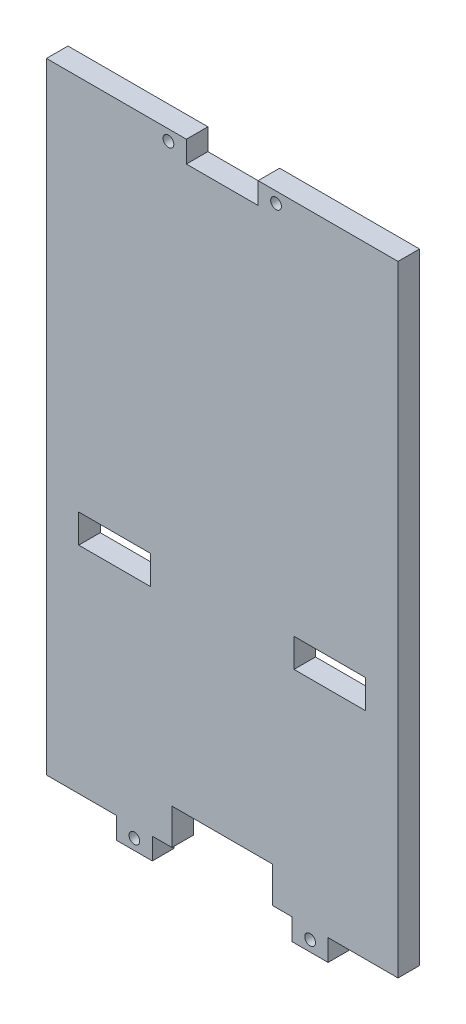
ISO-10303-21;
HEADER;
FILE_DESCRIPTION(('STEP AP214'),'2;1');
FILE_NAME('part.step','',(''),(''),'','','');
FILE_SCHEMA(('AUTOMOTIVE_DESIGN { 1 0 10303 214 1 1 1 1 }'));
ENDSEC;
DATA;
#1=APPLICATION_CONTEXT('core data for automotive mechanical design processes');
#2=APPLICATION_PROTOCOL_DEFINITION('international standard','automotive_design',2000,#1);
#3=PRODUCT_CONTEXT('',#1,'mechanical');
#4=PRODUCT('Part','Part','',(#3));
#5=PRODUCT_RELATED_PRODUCT_CATEGORY('part','',(#4));
#6=PRODUCT_DEFINITION_FORMATION('','',#4);
#7=PRODUCT_DEFINITION_CONTEXT('part definition',#1,'design');
#8=PRODUCT_DEFINITION('design','',#6,#7);
#9=PRODUCT_DEFINITION_SHAPE('','',#8);
#10=(LENGTH_UNIT() NAMED_UNIT(*) SI_UNIT(.MILLI.,.METRE.));
#11=(NAMED_UNIT(*) PLANE_ANGLE_UNIT() SI_UNIT($,.RADIAN.));
#12=(NAMED_UNIT(*) SI_UNIT($,.STERADIAN.) SOLID_ANGLE_UNIT());
#13=UNCERTAINTY_MEASURE_WITH_UNIT(LENGTH_MEASURE(1.E-05),#10,'distance_accuracy_value','');
#14=(GEOMETRIC_REPRESENTATION_CONTEXT(3) GLOBAL_UNCERTAINTY_ASSIGNED_CONTEXT((#13)) GLOBAL_UNIT_ASSIGNED_CONTEXT((#10,
#11,#12)) REPRESENTATION_CONTEXT('',''));
#15=CARTESIAN_POINT('',(0.,0.,0.));
#16=DIRECTION('',(0.,0.,1.));
#17=DIRECTION('',(1.,0.,0.));
#18=AXIS2_PLACEMENT_3D('',#15,#16,#17);
#19=CARTESIAN_POINT('',(-49.,-86.5,6.));
#20=DIRECTION('',(0.,1.,0.));
#21=DIRECTION('',(0.,0.,1.));
#22=AXIS2_PLACEMENT_3D('',#19,#20,#21);
#23=PLANE('',#22);
#24=DIRECTION('',(1.,0.,0.));
#25=VECTOR('',#24,1.);
#26=CARTESIAN_POINT('',(-49.,-86.5,0.));
#27=LINE('',#26,#25);
#28=CARTESIAN_POINT('',(-19.5,-86.5,0.));
#29=VERTEX_POINT('',#28);
#30=CARTESIAN_POINT('',(-14.,-86.5,0.));
#31=VERTEX_POINT('',#30);
#32=EDGE_CURVE('E238',#29,#31,#27,.T.);
#33=ORIENTED_EDGE('',*,*,#32,.T.);
#34=DIRECTION('',(0.,0.,1.));
#35=VECTOR('',#34,1.);
#36=CARTESIAN_POINT('',(-14.,-86.5,0.));
#37=LINE('',#36,#35);
#38=CARTESIAN_POINT('',(-14.,-86.5,6.));
#39=VERTEX_POINT('',#38);
#40=EDGE_CURVE('E221',#31,#39,#37,.T.);
#41=ORIENTED_EDGE('',*,*,#40,.T.);
#42=DIRECTION('',(1.,0.,0.));
#43=VECTOR('',#42,1.);
#44=CARTESIAN_POINT('',(-49.,-86.5,6.));
#45=LINE('',#44,#43);
#46=CARTESIAN_POINT('',(-19.5,-86.5,6.));
#47=VERTEX_POINT('',#46);
#48=EDGE_CURVE('E258',#47,#39,#45,.T.);
#49=ORIENTED_EDGE('',*,*,#48,.F.);
#50=DIRECTION('',(0.,0.,1.));
#51=VECTOR('',#50,1.);
#52=CARTESIAN_POINT('',(-19.5,-86.5,0.));
#53=LINE('',#52,#51);
#54=EDGE_CURVE('E245',#29,#47,#53,.T.);
#55=ORIENTED_EDGE('',*,*,#54,.F.);
#56=EDGE_LOOP('',(#33,#41,#49,#55));
#57=FACE_BOUND('',#56,.T.);
#58=ADVANCED_FACE('F33',(#57),#23,.F.);
#59=CARTESIAN_POINT('',(-49.,86.4999999999999,6.));
#60=DIRECTION('',(0.,-1.,0.));
#61=DIRECTION('',(0.,0.,-1.));
#62=AXIS2_PLACEMENT_3D('',#59,#60,#61);
#63=PLANE('',#62);
#64=DIRECTION('',(-1.,0.,0.));
#65=VECTOR('',#64,1.);
#66=CARTESIAN_POINT('',(-49.,86.4999999999999,6.));
#67=LINE('',#66,#65);
#68=CARTESIAN_POINT('',(-9.99999999999997,86.4999999999999,6.));
#69=VERTEX_POINT('',#68);
#70=CARTESIAN_POINT('',(-49.,86.4999999999999,6.));
#71=VERTEX_POINT('',#70);
#72=EDGE_CURVE('E428',#69,#71,#67,.T.);
#73=ORIENTED_EDGE('',*,*,#72,.F.);
#74=DIRECTION('',(0.,0.,1.));
#75=VECTOR('',#74,1.);
#76=CARTESIAN_POINT('',(-9.99999999999997,86.4999999999999,0.));
#77=LINE('',#76,#75);
#78=CARTESIAN_POINT('',(-9.99999999999997,86.4999999999999,0.));
#79=VERTEX_POINT('',#78);
#80=EDGE_CURVE('E325',#79,#69,#77,.T.);
#81=ORIENTED_EDGE('',*,*,#80,.F.);
#82=DIRECTION('',(-1.,0.,0.));
#83=VECTOR('',#82,1.);
#84=CARTESIAN_POINT('',(-49.,86.4999999999999,0.));
#85=LINE('',#84,#83);
#86=CARTESIAN_POINT('',(-49.,86.4999999999999,0.));
#87=VERTEX_POINT('',#86);
#88=EDGE_CURVE('E282',#79,#87,#85,.T.);
#89=ORIENTED_EDGE('',*,*,#88,.T.);
#90=DIRECTION('',(0.,0.,-1.));
#91=VECTOR('',#90,1.);
#92=CARTESIAN_POINT('',(-49.,86.4999999999999,6.));
#93=LINE('',#92,#91);
#94=EDGE_CURVE('E276',#71,#87,#93,.T.);
#95=ORIENTED_EDGE('',*,*,#94,.F.);
#96=EDGE_LOOP('',(#73,#81,#89,#95));
#97=FACE_BOUND('',#96,.T.);
#98=ADVANCED_FACE('F437',(#97),#63,.F.);
#99=CARTESIAN_POINT('',(14.,-86.5,6.));
#100=VERTEX_POINT('',#99);
#101=CARTESIAN_POINT('',(19.5,-86.5,6.));
#102=VERTEX_POINT('',#101);
#103=EDGE_CURVE('E37',#100,#102,#45,.T.);
#104=ORIENTED_EDGE('',*,*,#103,.F.);
#105=DIRECTION('',(0.,0.,1.));
#106=VECTOR('',#105,1.);
#107=CARTESIAN_POINT('',(14.,-86.5,0.));
#108=LINE('',#107,#106);
#109=CARTESIAN_POINT('',(14.,-86.5,0.));
#110=VERTEX_POINT('',#109);
#111=EDGE_CURVE('E231',#110,#100,#108,.T.);
#112=ORIENTED_EDGE('',*,*,#111,.F.);
#113=CARTESIAN_POINT('',(19.5,-86.5,0.));
#114=VERTEX_POINT('',#113);
#115=EDGE_CURVE('E247',#110,#114,#27,.T.);
#116=ORIENTED_EDGE('',*,*,#115,.T.);
#117=DIRECTION('',(0.,0.,1.));
#118=VECTOR('',#117,1.);
#119=CARTESIAN_POINT('',(19.5,-86.5,0.));
#120=LINE('',#119,#118);
#121=EDGE_CURVE('E394',#114,#102,#120,.T.);
#122=ORIENTED_EDGE('',*,*,#121,.T.);
#123=EDGE_LOOP('',(#104,#112,#116,#122));
#124=FACE_BOUND('',#123,.T.);
#125=ADVANCED_FACE('F454',(#124),#23,.F.);
#126=DIRECTION('',(0.,0.,1.));
#127=VECTOR('',#126,1.);
#128=CARTESIAN_POINT('',(29.5,-86.5,0.));
#129=LINE('',#128,#127);
#130=CARTESIAN_POINT('',(29.5,-86.5,0.));
#131=VERTEX_POINT('',#130);
#132=CARTESIAN_POINT('',(29.5,-86.5,6.));
#133=VERTEX_POINT('',#132);
#134=EDGE_CURVE('E382',#131,#133,#129,.T.);
#135=ORIENTED_EDGE('',*,*,#134,.F.);
#136=CARTESIAN_POINT('',(49.,-86.5,0.));
#137=VERTEX_POINT('',#136);
#138=EDGE_CURVE('E252',#131,#137,#27,.T.);
#139=ORIENTED_EDGE('',*,*,#138,.T.);
#140=DIRECTION('',(0.,0.,-1.));
#141=VECTOR('',#140,1.);
#142=CARTESIAN_POINT('',(49.,-86.5,6.));
#143=LINE('',#142,#141);
#144=CARTESIAN_POINT('',(49.,-86.5,6.));
#145=VERTEX_POINT('',#144);
#146=EDGE_CURVE('E43',#145,#137,#143,.T.);
#147=ORIENTED_EDGE('',*,*,#146,.F.);
#148=EDGE_CURVE('E286',#133,#145,#45,.T.);
#149=ORIENTED_EDGE('',*,*,#148,.F.);
#150=EDGE_LOOP('',(#135,#139,#147,#149));
#151=FACE_BOUND('',#150,.T.);
#152=ADVANCED_FACE('F464',(#151),#23,.F.);
#153=CARTESIAN_POINT('',(0.,0.,6.));
#154=DIRECTION('',(0.,0.,1.));
#155=DIRECTION('',(1.,0.,0.));
#156=AXIS2_PLACEMENT_3D('',#153,#154,#155);
#157=PLANE('',#156);
#158=DIRECTION('',(0.,-1.,0.));
#159=VECTOR('',#158,1.);
#160=CARTESIAN_POINT('',(-14.,-86.5,6.));
#161=LINE('',#160,#159);
#162=CARTESIAN_POINT('',(-14.,-76.5000000000001,6.));
#163=VERTEX_POINT('',#162);
#164=EDGE_CURVE('E226',#163,#39,#161,.T.);
#165=ORIENTED_EDGE('',*,*,#164,.F.);
#166=DIRECTION('',(-1.,0.,0.));
#167=VECTOR('',#166,1.);
#168=CARTESIAN_POINT('',(-14.,-76.5000000000001,6.));
#169=LINE('',#168,#167);
#170=CARTESIAN_POINT('',(14.,-76.5000000000001,6.));
#171=VERTEX_POINT('',#170);
#172=EDGE_CURVE('E241',#171,#163,#169,.T.);
#173=ORIENTED_EDGE('',*,*,#172,.F.);
#174=DIRECTION('',(0.,1.,0.));
#175=VECTOR('',#174,1.);
#176=CARTESIAN_POINT('',(14.,-86.5,6.));
#177=LINE('',#176,#175);
#178=EDGE_CURVE('E447',#100,#171,#177,.T.);
#179=ORIENTED_EDGE('',*,*,#178,.F.);
#180=ORIENTED_EDGE('',*,*,#103,.T.);
#181=DIRECTION('',(0.,-1.,0.));
#182=VECTOR('',#181,1.);
#183=CARTESIAN_POINT('',(19.5,-86.5,6.));
#184=LINE('',#183,#182);
#185=CARTESIAN_POINT('',(19.5,-92.5000000000001,6.));
#186=VERTEX_POINT('',#185);
#187=EDGE_CURVE('E388',#102,#186,#184,.T.);
#188=ORIENTED_EDGE('',*,*,#187,.T.);
#189=DIRECTION('',(1.,0.,0.));
#190=VECTOR('',#189,1.);
#191=CARTESIAN_POINT('',(29.5,-92.5000000000001,6.));
#192=LINE('',#191,#190);
#193=CARTESIAN_POINT('',(29.5,-92.5000000000001,6.));
#194=VERTEX_POINT('',#193);
#195=EDGE_CURVE('E384',#186,#194,#192,.T.);
#196=ORIENTED_EDGE('',*,*,#195,.T.);
#197=DIRECTION('',(0.,1.,0.));
#198=VECTOR('',#197,1.);
#199=CARTESIAN_POINT('',(29.5,-86.5,6.));
#200=LINE('',#199,#198);
#201=EDGE_CURVE('E372',#194,#133,#200,.T.);
#202=ORIENTED_EDGE('',*,*,#201,.T.);
#203=ORIENTED_EDGE('',*,*,#148,.T.);
#204=DIRECTION('',(0.,1.,0.));
#205=VECTOR('',#204,1.);
#206=CARTESIAN_POINT('',(49.,86.4999999999999,6.));
#207=LINE('',#206,#205);
#208=CARTESIAN_POINT('',(49.,86.4999999999999,6.));
#209=VERTEX_POINT('',#208);
#210=EDGE_CURVE('E424',#145,#209,#207,.T.);
#211=ORIENTED_EDGE('',*,*,#210,.T.);
#212=CARTESIAN_POINT('',(10.,86.4999999999999,6.));
#213=VERTEX_POINT('',#212);
#214=EDGE_CURVE('E278',#209,#213,#67,.T.);
#215=ORIENTED_EDGE('',*,*,#214,.T.);
#216=DIRECTION('',(0.,1.,0.));
#217=VECTOR('',#216,1.);
#218=CARTESIAN_POINT('',(10.,86.4999999999999,6.));
#219=LINE('',#218,#217);
#220=CARTESIAN_POINT('',(10.,80.4999999999999,6.));
#221=VERTEX_POINT('',#220);
#222=EDGE_CURVE('E59',#221,#213,#219,.T.);
#223=ORIENTED_EDGE('',*,*,#222,.F.);
#224=DIRECTION('',(1.,0.,0.));
#225=VECTOR('',#224,1.);
#226=CARTESIAN_POINT('',(-9.99999999999997,80.4999999999999,6.));
#227=LINE('',#226,#225);
#228=CARTESIAN_POINT('',(-9.99999999999997,80.4999999999999,6.));
#229=VERTEX_POINT('',#228);
#230=EDGE_CURVE('E320',#229,#221,#227,.T.);
#231=ORIENTED_EDGE('',*,*,#230,.F.);
#232=DIRECTION('',(0.,-1.,0.));
#233=VECTOR('',#232,1.);
#234=CARTESIAN_POINT('',(-9.99999999999997,86.4999999999999,6.));
#235=LINE('',#234,#233);
#236=EDGE_CURVE('E317',#69,#229,#235,.T.);
#237=ORIENTED_EDGE('',*,*,#236,.F.);
#238=ORIENTED_EDGE('',*,*,#72,.T.);
#239=DIRECTION('',(0.,-1.,0.));
#240=VECTOR('',#239,1.);
#241=CARTESIAN_POINT('',(-49.,86.4999999999999,6.));
#242=LINE('',#241,#240);
#243=CARTESIAN_POINT('',(-49.,-86.5,6.));
#244=VERTEX_POINT('',#243);
#245=EDGE_CURVE('E281',#71,#244,#242,.T.);
#246=ORIENTED_EDGE('',*,*,#245,.T.);
#247=CARTESIAN_POINT('',(-29.5,-86.5,6.));
#248=VERTEX_POINT('',#247);
#249=EDGE_CURVE('E420',#244,#248,#45,.T.);
#250=ORIENTED_EDGE('',*,*,#249,.T.);
#251=DIRECTION('',(0.,-1.,0.));
#252=VECTOR('',#251,1.);
#253=CARTESIAN_POINT('',(-29.5,-86.5,6.));
#254=LINE('',#253,#252);
#255=CARTESIAN_POINT('',(-29.5,-92.5000000000001,6.));
#256=VERTEX_POINT('',#255);
#257=EDGE_CURVE('E365',#248,#256,#254,.T.);
#258=ORIENTED_EDGE('',*,*,#257,.T.);
#259=DIRECTION('',(1.,0.,0.));
#260=VECTOR('',#259,1.);
#261=CARTESIAN_POINT('',(-19.5,-92.5000000000001,6.));
#262=LINE('',#261,#260);
#263=CARTESIAN_POINT('',(-19.5,-92.5000000000001,6.));
#264=VERTEX_POINT('',#263);
#265=EDGE_CURVE('E358',#256,#264,#262,.T.);
#266=ORIENTED_EDGE('',*,*,#265,.T.);
#267=DIRECTION('',(0.,1.,0.));
#268=VECTOR('',#267,1.);
#269=CARTESIAN_POINT('',(-19.5,-86.5,6.));
#270=LINE('',#269,#268);
#271=EDGE_CURVE('E352',#264,#47,#270,.T.);
#272=ORIENTED_EDGE('',*,*,#271,.T.);
#273=ORIENTED_EDGE('',*,*,#48,.T.);
#274=EDGE_LOOP('',(#165,#173,#179,#180,#188,#196,#202,#203,#211,#215,#223,#231,#237,#238,#246,
#250,#258,#266,#272,#273));
#275=FACE_BOUND('',#274,.T.);
#276=CARTESIAN_POINT('',(-24.5,-89.5000000000001,6.));
#277=DIRECTION('',(0.,0.,1.));
#278=DIRECTION('',(1.,0.,0.));
#279=AXIS2_PLACEMENT_3D('',#276,#277,#278);
#280=CIRCLE('',#279,1.5);
#281=CARTESIAN_POINT('',(-23.,-89.5000000000001,6.));
#282=VERTEX_POINT('',#281);
#283=EDGE_CURVE('E327',#282,#282,#280,.T.);
#284=ORIENTED_EDGE('',*,*,#283,.F.);
#285=EDGE_LOOP('',(#284));
#286=FACE_BOUND('',#285,.T.);
#287=CARTESIAN_POINT('',(24.5,-89.5000000000001,6.));
#288=DIRECTION('',(0.,0.,1.));
#289=DIRECTION('',(1.,0.,0.));
#290=AXIS2_PLACEMENT_3D('',#287,#288,#289);
#291=CIRCLE('',#290,1.5);
#292=CARTESIAN_POINT('',(26.,-89.5000000000001,6.));
#293=VERTEX_POINT('',#292);
#294=EDGE_CURVE('E334',#293,#293,#291,.T.);
#295=ORIENTED_EDGE('',*,*,#294,.F.);
#296=EDGE_LOOP('',(#295));
#297=FACE_BOUND('',#296,.T.);
#298=CARTESIAN_POINT('',(15.,83.4999999999999,6.));
#299=DIRECTION('',(0.,0.,1.));
#300=DIRECTION('',(1.,0.,0.));
#301=AXIS2_PLACEMENT_3D('',#298,#299,#300);
#302=CIRCLE('',#301,1.5);
#303=CARTESIAN_POINT('',(16.5,83.4999999999999,6.));
#304=VERTEX_POINT('',#303);
#305=EDGE_CURVE('E340',#304,#304,#302,.T.);
#306=ORIENTED_EDGE('',*,*,#305,.F.);
#307=EDGE_LOOP('',(#306));
#308=FACE_BOUND('',#307,.T.);
#309=CARTESIAN_POINT('',(-15.,83.4999999999999,6.));
#310=DIRECTION('',(0.,0.,1.));
#311=DIRECTION('',(1.,0.,0.));
#312=AXIS2_PLACEMENT_3D('',#309,#310,#311);
#313=CIRCLE('',#312,1.5);
#314=CARTESIAN_POINT('',(-13.5,83.4999999999999,6.));
#315=VERTEX_POINT('',#314);
#316=EDGE_CURVE('E346',#315,#315,#313,.T.);
#317=ORIENTED_EDGE('',*,*,#316,.F.);
#318=EDGE_LOOP('',(#317));
#319=FACE_BOUND('',#318,.T.);
#320=DIRECTION('',(1.,0.,0.));
#321=VECTOR('',#320,1.);
#322=CARTESIAN_POINT('',(-40.,-26.5,6.));
#323=LINE('',#322,#321);
#324=CARTESIAN_POINT('',(-40.,-26.5,6.));
#325=VERTEX_POINT('',#324);
#326=CARTESIAN_POINT('',(-20.,-26.5,6.));
#327=VERTEX_POINT('',#326);
#328=EDGE_CURVE('E496',#325,#327,#323,.T.);
#329=ORIENTED_EDGE('',*,*,#328,.F.);
#330=DIRECTION('',(0.,-1.,0.));
#331=VECTOR('',#330,1.);
#332=CARTESIAN_POINT('',(-40.,-18.5,6.));
#333=LINE('',#332,#331);
#334=CARTESIAN_POINT('',(-40.,-18.5,6.));
#335=VERTEX_POINT('',#334);
#336=EDGE_CURVE('E482',#335,#325,#333,.T.);
#337=ORIENTED_EDGE('',*,*,#336,.F.);
#338=DIRECTION('',(-1.,0.,0.));
#339=VECTOR('',#338,1.);
#340=CARTESIAN_POINT('',(-40.,-18.5,6.));
#341=LINE('',#340,#339);
#342=CARTESIAN_POINT('',(-20.,-18.5,6.));
#343=VERTEX_POINT('',#342);
#344=EDGE_CURVE('E478',#343,#335,#341,.T.);
#345=ORIENTED_EDGE('',*,*,#344,.F.);
#346=DIRECTION('',(0.,1.,0.));
#347=VECTOR('',#346,1.);
#348=CARTESIAN_POINT('',(-20.,-18.5,6.));
#349=LINE('',#348,#347);
#350=EDGE_CURVE('E493',#327,#343,#349,.T.);
#351=ORIENTED_EDGE('',*,*,#350,.F.);
#352=EDGE_LOOP('',(#329,#337,#345,#351));
#353=FACE_BOUND('',#352,.T.);
#354=DIRECTION('',(0.,-1.,0.));
#355=VECTOR('',#354,1.);
#356=CARTESIAN_POINT('',(20.,-18.5,6.));
#357=LINE('',#356,#355);
#358=CARTESIAN_POINT('',(20.,-18.5,6.));
#359=VERTEX_POINT('',#358);
#360=CARTESIAN_POINT('',(20.,-26.5,6.));
#361=VERTEX_POINT('',#360);
#362=EDGE_CURVE('E525',#359,#361,#357,.T.);
#363=ORIENTED_EDGE('',*,*,#362,.F.);
#364=DIRECTION('',(-1.,0.,0.));
#365=VECTOR('',#364,1.);
#366=CARTESIAN_POINT('',(40.,-18.5,6.));
#367=LINE('',#366,#365);
#368=CARTESIAN_POINT('',(40.,-18.5,6.));
#369=VERTEX_POINT('',#368);
#370=EDGE_CURVE('E512',#369,#359,#367,.T.);
#371=ORIENTED_EDGE('',*,*,#370,.F.);
#372=DIRECTION('',(0.,1.,0.));
#373=VECTOR('',#372,1.);
#374=CARTESIAN_POINT('',(40.,-18.5,6.));
#375=LINE('',#374,#373);
#376=CARTESIAN_POINT('',(40.,-26.5,6.));
#377=VERTEX_POINT('',#376);
#378=EDGE_CURVE('E508',#377,#369,#375,.T.);
#379=ORIENTED_EDGE('',*,*,#378,.F.);
#380=DIRECTION('',(1.,0.,0.));
#381=VECTOR('',#380,1.);
#382=CARTESIAN_POINT('',(40.,-26.5,6.));
#383=LINE('',#382,#381);
#384=EDGE_CURVE('E522',#361,#377,#383,.T.);
#385=ORIENTED_EDGE('',*,*,#384,.F.);
#386=EDGE_LOOP('',(#363,#371,#379,#385));
#387=FACE_BOUND('',#386,.T.);
#388=ADVANCED_FACE('F431',(#275,#286,#297,#308,#319,#353,#387),#157,.T.);
#389=CARTESIAN_POINT('',(0.,0.,0.));
#390=DIRECTION('',(0.,0.,1.));
#391=DIRECTION('',(1.,0.,0.));
#392=AXIS2_PLACEMENT_3D('',#389,#390,#391);
#393=PLANE('',#392);
#394=DIRECTION('',(-1.,0.,0.));
#395=VECTOR('',#394,1.);
#396=CARTESIAN_POINT('',(-14.,-76.5000000000001,0.));
#397=LINE('',#396,#395);
#398=CARTESIAN_POINT('',(14.,-76.5000000000001,0.));
#399=VERTEX_POINT('',#398);
#400=CARTESIAN_POINT('',(-14.,-76.5000000000001,0.));
#401=VERTEX_POINT('',#400);
#402=EDGE_CURVE('E51',#399,#401,#397,.T.);
#403=ORIENTED_EDGE('',*,*,#402,.T.);
#404=DIRECTION('',(0.,-1.,0.));
#405=VECTOR('',#404,1.);
#406=CARTESIAN_POINT('',(-14.,-86.5,0.));
#407=LINE('',#406,#405);
#408=EDGE_CURVE('E224',#401,#31,#407,.T.);
#409=ORIENTED_EDGE('',*,*,#408,.T.);
#410=ORIENTED_EDGE('',*,*,#32,.F.);
#411=DIRECTION('',(0.,1.,0.));
#412=VECTOR('',#411,1.);
#413=CARTESIAN_POINT('',(-19.5,-86.5,0.));
#414=LINE('',#413,#412);
#415=CARTESIAN_POINT('',(-19.5,-92.5000000000001,0.));
#416=VERTEX_POINT('',#415);
#417=EDGE_CURVE('E355',#416,#29,#414,.T.);
#418=ORIENTED_EDGE('',*,*,#417,.F.);
#419=DIRECTION('',(1.,0.,0.));
#420=VECTOR('',#419,1.);
#421=CARTESIAN_POINT('',(-19.5,-92.5000000000001,0.));
#422=LINE('',#421,#420);
#423=CARTESIAN_POINT('',(-29.5,-92.5000000000001,0.));
#424=VERTEX_POINT('',#423);
#425=EDGE_CURVE('E361',#424,#416,#422,.T.);
#426=ORIENTED_EDGE('',*,*,#425,.F.);
#427=DIRECTION('',(0.,-1.,0.));
#428=VECTOR('',#427,1.);
#429=CARTESIAN_POINT('',(-29.5,-86.5,0.));
#430=LINE('',#429,#428);
#431=CARTESIAN_POINT('',(-29.5,-86.5,0.));
#432=VERTEX_POINT('',#431);
#433=EDGE_CURVE('E357',#432,#424,#430,.T.);
#434=ORIENTED_EDGE('',*,*,#433,.F.);
#435=CARTESIAN_POINT('',(-49.,-86.5,0.));
#436=VERTEX_POINT('',#435);
#437=EDGE_CURVE('E246',#436,#432,#27,.T.);
#438=ORIENTED_EDGE('',*,*,#437,.F.);
#439=DIRECTION('',(0.,-1.,0.));
#440=VECTOR('',#439,1.);
#441=CARTESIAN_POINT('',(-49.,86.4999999999999,0.));
#442=LINE('',#441,#440);
#443=EDGE_CURVE('E262',#87,#436,#442,.T.);
#444=ORIENTED_EDGE('',*,*,#443,.F.);
#445=ORIENTED_EDGE('',*,*,#88,.F.);
#446=DIRECTION('',(0.,-1.,0.));
#447=VECTOR('',#446,1.);
#448=CARTESIAN_POINT('',(-9.99999999999997,86.4999999999999,0.));
#449=LINE('',#448,#447);
#450=CARTESIAN_POINT('',(-9.99999999999997,80.4999999999999,0.));
#451=VERTEX_POINT('',#450);
#452=EDGE_CURVE('E313',#79,#451,#449,.T.);
#453=ORIENTED_EDGE('',*,*,#452,.T.);
#454=DIRECTION('',(1.,0.,0.));
#455=VECTOR('',#454,1.);
#456=CARTESIAN_POINT('',(-9.99999999999997,80.4999999999999,0.));
#457=LINE('',#456,#455);
#458=CARTESIAN_POINT('',(10.,80.4999999999999,0.));
#459=VERTEX_POINT('',#458);
#460=EDGE_CURVE('E308',#451,#459,#457,.T.);
#461=ORIENTED_EDGE('',*,*,#460,.T.);
#462=DIRECTION('',(0.,1.,0.));
#463=VECTOR('',#462,1.);
#464=CARTESIAN_POINT('',(10.,86.4999999999999,0.));
#465=LINE('',#464,#463);
#466=CARTESIAN_POINT('',(10.,86.4999999999999,0.));
#467=VERTEX_POINT('',#466);
#468=EDGE_CURVE('E305',#459,#467,#465,.T.);
#469=ORIENTED_EDGE('',*,*,#468,.T.);
#470=CARTESIAN_POINT('',(49.,86.4999999999999,0.));
#471=VERTEX_POINT('',#470);
#472=EDGE_CURVE('E279',#471,#467,#85,.T.);
#473=ORIENTED_EDGE('',*,*,#472,.F.);
#474=DIRECTION('',(0.,1.,0.));
#475=VECTOR('',#474,1.);
#476=CARTESIAN_POINT('',(49.,86.4999999999999,0.));
#477=LINE('',#476,#475);
#478=EDGE_CURVE('E250',#137,#471,#477,.T.);
#479=ORIENTED_EDGE('',*,*,#478,.F.);
#480=ORIENTED_EDGE('',*,*,#138,.F.);
#481=DIRECTION('',(0.,1.,0.));
#482=VECTOR('',#481,1.);
#483=CARTESIAN_POINT('',(29.5,-86.5,0.));
#484=LINE('',#483,#482);
#485=CARTESIAN_POINT('',(29.5,-92.5000000000001,0.));
#486=VERTEX_POINT('',#485);
#487=EDGE_CURVE('E387',#486,#131,#484,.T.);
#488=ORIENTED_EDGE('',*,*,#487,.F.);
#489=DIRECTION('',(1.,0.,0.));
#490=VECTOR('',#489,1.);
#491=CARTESIAN_POINT('',(29.5,-92.5000000000001,0.));
#492=LINE('',#491,#490);
#493=CARTESIAN_POINT('',(19.5,-92.5000000000001,0.));
#494=VERTEX_POINT('',#493);
#495=EDGE_CURVE('E379',#494,#486,#492,.T.);
#496=ORIENTED_EDGE('',*,*,#495,.F.);
#497=DIRECTION('',(0.,-1.,0.));
#498=VECTOR('',#497,1.);
#499=CARTESIAN_POINT('',(19.5,-86.5,0.));
#500=LINE('',#499,#498);
#501=EDGE_CURVE('E383',#114,#494,#500,.T.);
#502=ORIENTED_EDGE('',*,*,#501,.F.);
#503=ORIENTED_EDGE('',*,*,#115,.F.);
#504=DIRECTION('',(0.,1.,0.));
#505=VECTOR('',#504,1.);
#506=CARTESIAN_POINT('',(14.,-86.5,0.));
#507=LINE('',#506,#505);
#508=EDGE_CURVE('E240',#110,#399,#507,.T.);
#509=ORIENTED_EDGE('',*,*,#508,.T.);
#510=EDGE_LOOP('',(#403,#409,#410,#418,#426,#434,#438,#444,#445,#453,#461,#469,#473,#479,#480,
#488,#496,#502,#503,#509));
#511=FACE_BOUND('',#510,.T.);
#512=CARTESIAN_POINT('',(-24.5,-89.5000000000001,0.));
#513=DIRECTION('',(0.,0.,1.));
#514=DIRECTION('',(1.,0.,0.));
#515=AXIS2_PLACEMENT_3D('',#512,#513,#514);
#516=CIRCLE('',#515,1.5);
#517=CARTESIAN_POINT('',(-23.,-89.5000000000001,0.));
#518=VERTEX_POINT('',#517);
#519=EDGE_CURVE('E331',#518,#518,#516,.T.);
#520=ORIENTED_EDGE('',*,*,#519,.T.);
#521=EDGE_LOOP('',(#520));
#522=FACE_BOUND('',#521,.T.);
#523=CARTESIAN_POINT('',(24.5,-89.5000000000001,0.));
#524=DIRECTION('',(0.,0.,1.));
#525=DIRECTION('',(1.,0.,0.));
#526=AXIS2_PLACEMENT_3D('',#523,#524,#525);
#527=CIRCLE('',#526,1.5);
#528=CARTESIAN_POINT('',(26.,-89.5000000000001,0.));
#529=VERTEX_POINT('',#528);
#530=EDGE_CURVE('E337',#529,#529,#527,.T.);
#531=ORIENTED_EDGE('',*,*,#530,.T.);
#532=EDGE_LOOP('',(#531));
#533=FACE_BOUND('',#532,.T.);
#534=CARTESIAN_POINT('',(15.,83.4999999999999,0.));
#535=DIRECTION('',(0.,0.,1.));
#536=DIRECTION('',(1.,0.,0.));
#537=AXIS2_PLACEMENT_3D('',#534,#535,#536);
#538=CIRCLE('',#537,1.5);
#539=CARTESIAN_POINT('',(16.5,83.4999999999999,0.));
#540=VERTEX_POINT('',#539);
#541=EDGE_CURVE('E343',#540,#540,#538,.T.);
#542=ORIENTED_EDGE('',*,*,#541,.T.);
#543=EDGE_LOOP('',(#542));
#544=FACE_BOUND('',#543,.T.);
#545=CARTESIAN_POINT('',(-15.,83.4999999999999,0.));
#546=DIRECTION('',(0.,0.,1.));
#547=DIRECTION('',(1.,0.,0.));
#548=AXIS2_PLACEMENT_3D('',#545,#546,#547);
#549=CIRCLE('',#548,1.5);
#550=CARTESIAN_POINT('',(-13.5,83.4999999999999,0.));
#551=VERTEX_POINT('',#550);
#552=EDGE_CURVE('E349',#551,#551,#549,.T.);
#553=ORIENTED_EDGE('',*,*,#552,.T.);
#554=EDGE_LOOP('',(#553));
#555=FACE_BOUND('',#554,.T.);
#556=DIRECTION('',(0.,-1.,0.));
#557=VECTOR('',#556,1.);
#558=CARTESIAN_POINT('',(-40.,-18.5,0.));
#559=LINE('',#558,#557);
#560=CARTESIAN_POINT('',(-40.,-18.5,0.));
#561=VERTEX_POINT('',#560);
#562=CARTESIAN_POINT('',(-40.,-26.5,0.));
#563=VERTEX_POINT('',#562);
#564=EDGE_CURVE('E489',#561,#563,#559,.T.);
#565=ORIENTED_EDGE('',*,*,#564,.T.);
#566=DIRECTION('',(1.,0.,0.));
#567=VECTOR('',#566,1.);
#568=CARTESIAN_POINT('',(-40.,-26.5,0.));
#569=LINE('',#568,#567);
#570=CARTESIAN_POINT('',(-20.,-26.5,0.));
#571=VERTEX_POINT('',#570);
#572=EDGE_CURVE('E486',#563,#571,#569,.T.);
#573=ORIENTED_EDGE('',*,*,#572,.T.);
#574=DIRECTION('',(0.,1.,0.));
#575=VECTOR('',#574,1.);
#576=CARTESIAN_POINT('',(-20.,-18.5,0.));
#577=LINE('',#576,#575);
#578=CARTESIAN_POINT('',(-20.,-18.5,0.));
#579=VERTEX_POINT('',#578);
#580=EDGE_CURVE('E483',#571,#579,#577,.T.);
#581=ORIENTED_EDGE('',*,*,#580,.T.);
#582=DIRECTION('',(-1.,0.,0.));
#583=VECTOR('',#582,1.);
#584=CARTESIAN_POINT('',(-40.,-18.5,0.));
#585=LINE('',#584,#583);
#586=EDGE_CURVE('E479',#579,#561,#585,.T.);
#587=ORIENTED_EDGE('',*,*,#586,.T.);
#588=EDGE_LOOP('',(#565,#573,#581,#587));
#589=FACE_BOUND('',#588,.T.);
#590=DIRECTION('',(-1.,0.,0.));
#591=VECTOR('',#590,1.);
#592=CARTESIAN_POINT('',(40.,-18.5,0.));
#593=LINE('',#592,#591);
#594=CARTESIAN_POINT('',(40.,-18.5,0.));
#595=VERTEX_POINT('',#594);
#596=CARTESIAN_POINT('',(20.,-18.5,0.));
#597=VERTEX_POINT('',#596);
#598=EDGE_CURVE('E391',#595,#597,#593,.T.);
#599=ORIENTED_EDGE('',*,*,#598,.T.);
#600=DIRECTION('',(0.,-1.,0.));
#601=VECTOR('',#600,1.);
#602=CARTESIAN_POINT('',(20.,-18.5,0.));
#603=LINE('',#602,#601);
#604=CARTESIAN_POINT('',(20.,-26.5,0.));
#605=VERTEX_POINT('',#604);
#606=EDGE_CURVE('E516',#597,#605,#603,.T.);
#607=ORIENTED_EDGE('',*,*,#606,.T.);
#608=DIRECTION('',(1.,0.,0.));
#609=VECTOR('',#608,1.);
#610=CARTESIAN_POINT('',(40.,-26.5,0.));
#611=LINE('',#610,#609);
#612=CARTESIAN_POINT('',(40.,-26.5,0.));
#613=VERTEX_POINT('',#612);
#614=EDGE_CURVE('E513',#605,#613,#611,.T.);
#615=ORIENTED_EDGE('',*,*,#614,.T.);
#616=DIRECTION('',(0.,1.,0.));
#617=VECTOR('',#616,1.);
#618=CARTESIAN_POINT('',(40.,-18.5,0.));
#619=LINE('',#618,#617);
#620=EDGE_CURVE('E509',#613,#595,#619,.T.);
#621=ORIENTED_EDGE('',*,*,#620,.T.);
#622=EDGE_LOOP('',(#599,#607,#615,#621));
#623=FACE_BOUND('',#622,.T.);
#624=ADVANCED_FACE('F235',(#511,#522,#533,#544,#555,#589,#623),#393,.F.);
#625=CARTESIAN_POINT('',(-49.,86.4999999999999,6.));
#626=DIRECTION('',(1.,0.,0.));
#627=DIRECTION('',(0.,1.,0.));
#628=AXIS2_PLACEMENT_3D('',#625,#626,#627);
#629=PLANE('',#628);
#630=ORIENTED_EDGE('',*,*,#443,.T.);
#631=DIRECTION('',(0.,0.,-1.));
#632=VECTOR('',#631,1.);
#633=CARTESIAN_POINT('',(-49.,-86.5,6.));
#634=LINE('',#633,#632);
#635=EDGE_CURVE('E11',#244,#436,#634,.T.);
#636=ORIENTED_EDGE('',*,*,#635,.F.);
#637=ORIENTED_EDGE('',*,*,#245,.F.);
#638=ORIENTED_EDGE('',*,*,#94,.T.);
#639=EDGE_LOOP('',(#630,#636,#637,#638));
#640=FACE_BOUND('',#639,.T.);
#641=ADVANCED_FACE('F35',(#640),#629,.F.);
#642=ORIENTED_EDGE('',*,*,#437,.T.);
#643=DIRECTION('',(0.,0.,1.));
#644=VECTOR('',#643,1.);
#645=CARTESIAN_POINT('',(-29.5,-86.5,0.));
#646=LINE('',#645,#644);
#647=EDGE_CURVE('E375',#432,#248,#646,.T.);
#648=ORIENTED_EDGE('',*,*,#647,.T.);
#649=ORIENTED_EDGE('',*,*,#249,.F.);
#650=ORIENTED_EDGE('',*,*,#635,.T.);
#651=EDGE_LOOP('',(#642,#648,#649,#650));
#652=FACE_BOUND('',#651,.T.);
#653=ADVANCED_FACE('F442',(#652),#23,.F.);
#654=CARTESIAN_POINT('',(49.,86.4999999999999,6.));
#655=DIRECTION('',(-1.,0.,0.));
#656=DIRECTION('',(0.,-1.,0.));
#657=AXIS2_PLACEMENT_3D('',#654,#655,#656);
#658=PLANE('',#657);
#659=ORIENTED_EDGE('',*,*,#478,.T.);
#660=DIRECTION('',(0.,0.,-1.));
#661=VECTOR('',#660,1.);
#662=CARTESIAN_POINT('',(49.,86.4999999999999,6.));
#663=LINE('',#662,#661);
#664=EDGE_CURVE('E273',#209,#471,#663,.T.);
#665=ORIENTED_EDGE('',*,*,#664,.F.);
#666=ORIENTED_EDGE('',*,*,#210,.F.);
#667=ORIENTED_EDGE('',*,*,#146,.T.);
#668=EDGE_LOOP('',(#659,#665,#666,#667));
#669=FACE_BOUND('',#668,.T.);
#670=ADVANCED_FACE('F295',(#669),#658,.F.);
#671=ORIENTED_EDGE('',*,*,#472,.T.);
#672=DIRECTION('',(0.,0.,1.));
#673=VECTOR('',#672,1.);
#674=CARTESIAN_POINT('',(10.,86.4999999999999,0.));
#675=LINE('',#674,#673);
#676=EDGE_CURVE('E328',#467,#213,#675,.T.);
#677=ORIENTED_EDGE('',*,*,#676,.T.);
#678=ORIENTED_EDGE('',*,*,#214,.F.);
#679=ORIENTED_EDGE('',*,*,#664,.T.);
#680=EDGE_LOOP('',(#671,#677,#678,#679));
#681=FACE_BOUND('',#680,.T.);
#682=ADVANCED_FACE('F300',(#681),#63,.F.);
#683=CARTESIAN_POINT('',(-40.,-18.5,6.));
#684=DIRECTION('',(1.,0.,0.));
#685=DIRECTION('',(0.,1.,0.));
#686=AXIS2_PLACEMENT_3D('',#683,#684,#685);
#687=PLANE('',#686);
#688=ORIENTED_EDGE('',*,*,#564,.F.);
#689=DIRECTION('',(0.,0.,-1.));
#690=VECTOR('',#689,1.);
#691=CARTESIAN_POINT('',(-40.,-18.5,6.));
#692=LINE('',#691,#690);
#693=EDGE_CURVE('E475',#335,#561,#692,.T.);
#694=ORIENTED_EDGE('',*,*,#693,.F.);
#695=ORIENTED_EDGE('',*,*,#336,.T.);
#696=DIRECTION('',(0.,0.,-1.));
#697=VECTOR('',#696,1.);
#698=CARTESIAN_POINT('',(-40.,-26.5,6.));
#699=LINE('',#698,#697);
#700=EDGE_CURVE('E465',#325,#563,#699,.T.);
#701=ORIENTED_EDGE('',*,*,#700,.T.);
#702=EDGE_LOOP('',(#688,#694,#695,#701));
#703=FACE_BOUND('',#702,.T.);
#704=ADVANCED_FACE('F575',(#703),#687,.T.);
#705=CARTESIAN_POINT('',(-40.,-26.5,6.));
#706=DIRECTION('',(0.,1.,0.));
#707=DIRECTION('',(0.,0.,1.));
#708=AXIS2_PLACEMENT_3D('',#705,#706,#707);
#709=PLANE('',#708);
#710=ORIENTED_EDGE('',*,*,#572,.F.);
#711=ORIENTED_EDGE('',*,*,#700,.F.);
#712=ORIENTED_EDGE('',*,*,#328,.T.);
#713=DIRECTION('',(0.,0.,-1.));
#714=VECTOR('',#713,1.);
#715=CARTESIAN_POINT('',(-20.,-26.5,6.));
#716=LINE('',#715,#714);
#717=EDGE_CURVE('E467',#327,#571,#716,.T.);
#718=ORIENTED_EDGE('',*,*,#717,.T.);
#719=EDGE_LOOP('',(#710,#711,#712,#718));
#720=FACE_BOUND('',#719,.T.);
#721=ADVANCED_FACE('F581',(#720),#709,.T.);
#722=CARTESIAN_POINT('',(-20.,-18.5,6.));
#723=DIRECTION('',(-1.,0.,0.));
#724=DIRECTION('',(0.,0.,1.));
#725=AXIS2_PLACEMENT_3D('',#722,#723,#724);
#726=PLANE('',#725);
#727=ORIENTED_EDGE('',*,*,#580,.F.);
#728=ORIENTED_EDGE('',*,*,#717,.F.);
#729=ORIENTED_EDGE('',*,*,#350,.T.);
#730=DIRECTION('',(0.,0.,-1.));
#731=VECTOR('',#730,1.);
#732=CARTESIAN_POINT('',(-20.,-18.5,6.));
#733=LINE('',#732,#731);
#734=EDGE_CURVE('E471',#343,#579,#733,.T.);
#735=ORIENTED_EDGE('',*,*,#734,.T.);
#736=EDGE_LOOP('',(#727,#728,#729,#735));
#737=FACE_BOUND('',#736,.T.);
#738=ADVANCED_FACE('F585',(#737),#726,.T.);
#739=CARTESIAN_POINT('',(-40.,-18.5,6.));
#740=DIRECTION('',(0.,-1.,0.));
#741=DIRECTION('',(0.,0.,-1.));
#742=AXIS2_PLACEMENT_3D('',#739,#740,#741);
#743=PLANE('',#742);
#744=ORIENTED_EDGE('',*,*,#586,.F.);
#745=ORIENTED_EDGE('',*,*,#734,.F.);
#746=ORIENTED_EDGE('',*,*,#344,.T.);
#747=ORIENTED_EDGE('',*,*,#693,.T.);
#748=EDGE_LOOP('',(#744,#745,#746,#747));
#749=FACE_BOUND('',#748,.T.);
#750=ADVANCED_FACE('F592',(#749),#743,.T.);
#751=CARTESIAN_POINT('',(40.,-18.5,6.));
#752=DIRECTION('',(0.,-1.,0.));
#753=DIRECTION('',(1.,0.,0.));
#754=AXIS2_PLACEMENT_3D('',#751,#752,#753);
#755=PLANE('',#754);
#756=ORIENTED_EDGE('',*,*,#598,.F.);
#757=DIRECTION('',(0.,0.,-1.));
#758=VECTOR('',#757,1.);
#759=CARTESIAN_POINT('',(40.,-18.5,6.));
#760=LINE('',#759,#758);
#761=EDGE_CURVE('E505',#369,#595,#760,.T.);
#762=ORIENTED_EDGE('',*,*,#761,.F.);
#763=ORIENTED_EDGE('',*,*,#370,.T.);
#764=DIRECTION('',(0.,0.,-1.));
#765=VECTOR('',#764,1.);
#766=CARTESIAN_POINT('',(20.,-18.5,6.));
#767=LINE('',#766,#765);
#768=EDGE_CURVE('E491',#359,#597,#767,.T.);
#769=ORIENTED_EDGE('',*,*,#768,.T.);
#770=EDGE_LOOP('',(#756,#762,#763,#769));
#771=FACE_BOUND('',#770,.T.);
#772=ADVANCED_FACE('F530',(#771),#755,.T.);
#773=CARTESIAN_POINT('',(20.,-18.5,6.));
#774=DIRECTION('',(1.,0.,0.));
#775=DIRECTION('',(0.,0.,-1.));
#776=AXIS2_PLACEMENT_3D('',#773,#774,#775);
#777=PLANE('',#776);
#778=ORIENTED_EDGE('',*,*,#606,.F.);
#779=ORIENTED_EDGE('',*,*,#768,.F.);
#780=ORIENTED_EDGE('',*,*,#362,.T.);
#781=DIRECTION('',(0.,0.,-1.));
#782=VECTOR('',#781,1.);
#783=CARTESIAN_POINT('',(20.,-26.5,6.));
#784=LINE('',#783,#782);
#785=EDGE_CURVE('E501',#361,#605,#784,.T.);
#786=ORIENTED_EDGE('',*,*,#785,.T.);
#787=EDGE_LOOP('',(#778,#779,#780,#786));
#788=FACE_BOUND('',#787,.T.);
#789=ADVANCED_FACE('F535',(#788),#777,.T.);
#790=CARTESIAN_POINT('',(40.,-26.5,6.));
#791=DIRECTION('',(0.,1.,0.));
#792=DIRECTION('',(-1.,0.,0.));
#793=AXIS2_PLACEMENT_3D('',#790,#791,#792);
#794=PLANE('',#793);
#795=ORIENTED_EDGE('',*,*,#614,.F.);
#796=ORIENTED_EDGE('',*,*,#785,.F.);
#797=ORIENTED_EDGE('',*,*,#384,.T.);
#798=DIRECTION('',(0.,0.,-1.));
#799=VECTOR('',#798,1.);
#800=CARTESIAN_POINT('',(40.,-26.5,6.));
#801=LINE('',#800,#799);
#802=EDGE_CURVE('E503',#377,#613,#801,.T.);
#803=ORIENTED_EDGE('',*,*,#802,.T.);
#804=EDGE_LOOP('',(#795,#796,#797,#803));
#805=FACE_BOUND('',#804,.T.);
#806=ADVANCED_FACE('F540',(#805),#794,.T.);
#807=CARTESIAN_POINT('',(40.,-18.5,6.));
#808=DIRECTION('',(-1.,0.,0.));
#809=DIRECTION('',(0.,-1.,0.));
#810=AXIS2_PLACEMENT_3D('',#807,#808,#809);
#811=PLANE('',#810);
#812=ORIENTED_EDGE('',*,*,#620,.F.);
#813=ORIENTED_EDGE('',*,*,#802,.F.);
#814=ORIENTED_EDGE('',*,*,#378,.T.);
#815=ORIENTED_EDGE('',*,*,#761,.T.);
#816=EDGE_LOOP('',(#812,#813,#814,#815));
#817=FACE_BOUND('',#816,.T.);
#818=ADVANCED_FACE('F544',(#817),#811,.T.);
#819=CARTESIAN_POINT('',(29.5,-86.5,0.));
#820=DIRECTION('',(1.,0.,0.));
#821=DIRECTION('',(0.,0.,-1.));
#822=AXIS2_PLACEMENT_3D('',#819,#820,#821);
#823=PLANE('',#822);
#824=ORIENTED_EDGE('',*,*,#201,.F.);
#825=DIRECTION('',(0.,0.,1.));
#826=VECTOR('',#825,1.);
#827=CARTESIAN_POINT('',(29.5,-92.5000000000001,0.));
#828=LINE('',#827,#826);
#829=EDGE_CURVE('E389',#486,#194,#828,.T.);
#830=ORIENTED_EDGE('',*,*,#829,.F.);
#831=ORIENTED_EDGE('',*,*,#487,.T.);
#832=ORIENTED_EDGE('',*,*,#134,.T.);
#833=EDGE_LOOP('',(#824,#830,#831,#832));
#834=FACE_BOUND('',#833,.T.);
#835=ADVANCED_FACE('F461',(#834),#823,.T.);
#836=CARTESIAN_POINT('',(29.5,-92.5000000000001,0.));
#837=DIRECTION('',(0.,-1.,0.));
#838=DIRECTION('',(0.,0.,-1.));
#839=AXIS2_PLACEMENT_3D('',#836,#837,#838);
#840=PLANE('',#839);
#841=ORIENTED_EDGE('',*,*,#195,.F.);
#842=DIRECTION('',(0.,0.,1.));
#843=VECTOR('',#842,1.);
#844=CARTESIAN_POINT('',(19.5,-92.5000000000001,0.));
#845=LINE('',#844,#843);
#846=EDGE_CURVE('E392',#494,#186,#845,.T.);
#847=ORIENTED_EDGE('',*,*,#846,.F.);
#848=ORIENTED_EDGE('',*,*,#495,.T.);
#849=ORIENTED_EDGE('',*,*,#829,.T.);
#850=EDGE_LOOP('',(#841,#847,#848,#849));
#851=FACE_BOUND('',#850,.T.);
#852=ADVANCED_FACE('F459',(#851),#840,.T.);
#853=CARTESIAN_POINT('',(19.5,-86.5,0.));
#854=DIRECTION('',(-1.,0.,0.));
#855=DIRECTION('',(0.,-1.,0.));
#856=AXIS2_PLACEMENT_3D('',#853,#854,#855);
#857=PLANE('',#856);
#858=ORIENTED_EDGE('',*,*,#187,.F.);
#859=ORIENTED_EDGE('',*,*,#121,.F.);
#860=ORIENTED_EDGE('',*,*,#501,.T.);
#861=ORIENTED_EDGE('',*,*,#846,.T.);
#862=EDGE_LOOP('',(#858,#859,#860,#861));
#863=FACE_BOUND('',#862,.T.);
#864=ADVANCED_FACE('F452',(#863),#857,.T.);
#865=CARTESIAN_POINT('',(-19.5,-86.5,0.));
#866=DIRECTION('',(1.,0.,0.));
#867=DIRECTION('',(0.,0.,-1.));
#868=AXIS2_PLACEMENT_3D('',#865,#866,#867);
#869=PLANE('',#868);
#870=ORIENTED_EDGE('',*,*,#271,.F.);
#871=DIRECTION('',(0.,0.,1.));
#872=VECTOR('',#871,1.);
#873=CARTESIAN_POINT('',(-19.5,-92.5000000000001,0.));
#874=LINE('',#873,#872);
#875=EDGE_CURVE('E370',#416,#264,#874,.T.);
#876=ORIENTED_EDGE('',*,*,#875,.F.);
#877=ORIENTED_EDGE('',*,*,#417,.T.);
#878=ORIENTED_EDGE('',*,*,#54,.T.);
#879=EDGE_LOOP('',(#870,#876,#877,#878));
#880=FACE_BOUND('',#879,.T.);
#881=ADVANCED_FACE('F657',(#880),#869,.T.);
#882=CARTESIAN_POINT('',(-19.5,-92.5000000000001,0.));
#883=DIRECTION('',(0.,-1.,0.));
#884=DIRECTION('',(0.,0.,-1.));
#885=AXIS2_PLACEMENT_3D('',#882,#883,#884);
#886=PLANE('',#885);
#887=ORIENTED_EDGE('',*,*,#265,.F.);
#888=DIRECTION('',(0.,0.,1.));
#889=VECTOR('',#888,1.);
#890=CARTESIAN_POINT('',(-29.5,-92.5000000000001,0.));
#891=LINE('',#890,#889);
#892=EDGE_CURVE('E373',#424,#256,#891,.T.);
#893=ORIENTED_EDGE('',*,*,#892,.F.);
#894=ORIENTED_EDGE('',*,*,#425,.T.);
#895=ORIENTED_EDGE('',*,*,#875,.T.);
#896=EDGE_LOOP('',(#887,#893,#894,#895));
#897=FACE_BOUND('',#896,.T.);
#898=ADVANCED_FACE('F666',(#897),#886,.T.);
#899=CARTESIAN_POINT('',(-29.5,-86.5,0.));
#900=DIRECTION('',(-1.,0.,0.));
#901=DIRECTION('',(0.,-1.,0.));
#902=AXIS2_PLACEMENT_3D('',#899,#900,#901);
#903=PLANE('',#902);
#904=ORIENTED_EDGE('',*,*,#257,.F.);
#905=ORIENTED_EDGE('',*,*,#647,.F.);
#906=ORIENTED_EDGE('',*,*,#433,.T.);
#907=ORIENTED_EDGE('',*,*,#892,.T.);
#908=EDGE_LOOP('',(#904,#905,#906,#907));
#909=FACE_BOUND('',#908,.T.);
#910=ADVANCED_FACE('F676',(#909),#903,.T.);
#911=CARTESIAN_POINT('',(-15.,83.4999999999999,0.));
#912=DIRECTION('',(0.,0.,1.));
#913=DIRECTION('',(1.,0.,0.));
#914=AXIS2_PLACEMENT_3D('',#911,#912,#913);
#915=CYLINDRICAL_SURFACE('',#914,1.5);
#916=ORIENTED_EDGE('',*,*,#552,.F.);
#917=EDGE_LOOP('',(#916));
#918=FACE_BOUND('',#917,.T.);
#919=ORIENTED_EDGE('',*,*,#316,.T.);
#920=EDGE_LOOP('',(#919));
#921=FACE_BOUND('',#920,.T.);
#922=ADVANCED_FACE('F686',(#918,#921),#915,.F.);
#923=CARTESIAN_POINT('',(15.,83.4999999999999,0.));
#924=DIRECTION('',(0.,0.,1.));
#925=DIRECTION('',(1.,0.,0.));
#926=AXIS2_PLACEMENT_3D('',#923,#924,#925);
#927=CYLINDRICAL_SURFACE('',#926,1.5);
#928=ORIENTED_EDGE('',*,*,#541,.F.);
#929=EDGE_LOOP('',(#928));
#930=FACE_BOUND('',#929,.T.);
#931=ORIENTED_EDGE('',*,*,#305,.T.);
#932=EDGE_LOOP('',(#931));
#933=FACE_BOUND('',#932,.T.);
#934=ADVANCED_FACE('F696',(#930,#933),#927,.F.);
#935=CARTESIAN_POINT('',(24.5,-89.5000000000001,0.));
#936=DIRECTION('',(0.,0.,1.));
#937=DIRECTION('',(1.,0.,0.));
#938=AXIS2_PLACEMENT_3D('',#935,#936,#937);
#939=CYLINDRICAL_SURFACE('',#938,1.5);
#940=ORIENTED_EDGE('',*,*,#530,.F.);
#941=EDGE_LOOP('',(#940));
#942=FACE_BOUND('',#941,.T.);
#943=ORIENTED_EDGE('',*,*,#294,.T.);
#944=EDGE_LOOP('',(#943));
#945=FACE_BOUND('',#944,.T.);
#946=ADVANCED_FACE('F706',(#942,#945),#939,.F.);
#947=CARTESIAN_POINT('',(-24.5,-89.5000000000001,0.));
#948=DIRECTION('',(0.,0.,1.));
#949=DIRECTION('',(1.,0.,0.));
#950=AXIS2_PLACEMENT_3D('',#947,#948,#949);
#951=CYLINDRICAL_SURFACE('',#950,1.5);
#952=ORIENTED_EDGE('',*,*,#519,.F.);
#953=EDGE_LOOP('',(#952));
#954=FACE_BOUND('',#953,.T.);
#955=ORIENTED_EDGE('',*,*,#283,.T.);
#956=EDGE_LOOP('',(#955));
#957=FACE_BOUND('',#956,.T.);
#958=ADVANCED_FACE('F716',(#954,#957),#951,.F.);
#959=CARTESIAN_POINT('',(-9.99999999999997,86.4999999999999,0.));
#960=DIRECTION('',(-1.,0.,0.));
#961=DIRECTION('',(0.,-1.,0.));
#962=AXIS2_PLACEMENT_3D('',#959,#960,#961);
#963=PLANE('',#962);
#964=ORIENTED_EDGE('',*,*,#236,.T.);
#965=DIRECTION('',(0.,0.,1.));
#966=VECTOR('',#965,1.);
#967=CARTESIAN_POINT('',(-9.99999999999997,80.4999999999999,0.));
#968=LINE('',#967,#966);
#969=EDGE_CURVE('E309',#451,#229,#968,.T.);
#970=ORIENTED_EDGE('',*,*,#969,.F.);
#971=ORIENTED_EDGE('',*,*,#452,.F.);
#972=ORIENTED_EDGE('',*,*,#80,.T.);
#973=EDGE_LOOP('',(#964,#970,#971,#972));
#974=FACE_BOUND('',#973,.T.);
#975=ADVANCED_FACE('F725',(#974),#963,.F.);
#976=CARTESIAN_POINT('',(10.,86.4999999999999,0.));
#977=DIRECTION('',(1.,0.,0.));
#978=DIRECTION('',(0.,1.,0.));
#979=AXIS2_PLACEMENT_3D('',#976,#977,#978);
#980=PLANE('',#979);
#981=ORIENTED_EDGE('',*,*,#222,.T.);
#982=ORIENTED_EDGE('',*,*,#676,.F.);
#983=ORIENTED_EDGE('',*,*,#468,.F.);
#984=DIRECTION('',(0.,0.,1.));
#985=VECTOR('',#984,1.);
#986=CARTESIAN_POINT('',(10.,80.4999999999999,0.));
#987=LINE('',#986,#985);
#988=EDGE_CURVE('E311',#459,#221,#987,.T.);
#989=ORIENTED_EDGE('',*,*,#988,.T.);
#990=EDGE_LOOP('',(#981,#982,#983,#989));
#991=FACE_BOUND('',#990,.T.);
#992=ADVANCED_FACE('F767',(#991),#980,.F.);
#993=CARTESIAN_POINT('',(-9.99999999999997,80.4999999999999,0.));
#994=DIRECTION('',(0.,-1.,0.));
#995=DIRECTION('',(0.,0.,-1.));
#996=AXIS2_PLACEMENT_3D('',#993,#994,#995);
#997=PLANE('',#996);
#998=ORIENTED_EDGE('',*,*,#230,.T.);
#999=ORIENTED_EDGE('',*,*,#988,.F.);
#1000=ORIENTED_EDGE('',*,*,#460,.F.);
#1001=ORIENTED_EDGE('',*,*,#969,.T.);
#1002=EDGE_LOOP('',(#998,#999,#1000,#1001));
#1003=FACE_BOUND('',#1002,.T.);
#1004=ADVANCED_FACE('F777',(#1003),#997,.F.);
#1005=CARTESIAN_POINT('',(-14.,-86.5,0.));
#1006=DIRECTION('',(-1.,0.,0.));
#1007=DIRECTION('',(0.,-1.,0.));
#1008=AXIS2_PLACEMENT_3D('',#1005,#1006,#1007);
#1009=PLANE('',#1008);
#1010=ORIENTED_EDGE('',*,*,#164,.T.);
#1011=ORIENTED_EDGE('',*,*,#40,.F.);
#1012=ORIENTED_EDGE('',*,*,#408,.F.);
#1013=DIRECTION('',(0.,0.,1.));
#1014=VECTOR('',#1013,1.);
#1015=CARTESIAN_POINT('',(-14.,-76.5000000000001,0.));
#1016=LINE('',#1015,#1014);
#1017=EDGE_CURVE('E321',#401,#163,#1016,.T.);
#1018=ORIENTED_EDGE('',*,*,#1017,.T.);
#1019=EDGE_LOOP('',(#1010,#1011,#1012,#1018));
#1020=FACE_BOUND('',#1019,.T.);
#1021=ADVANCED_FACE('F223',(#1020),#1009,.F.);
#1022=CARTESIAN_POINT('',(-14.,-76.5000000000001,0.));
#1023=DIRECTION('',(0.,1.,0.));
#1024=DIRECTION('',(0.,0.,1.));
#1025=AXIS2_PLACEMENT_3D('',#1022,#1023,#1024);
#1026=PLANE('',#1025);
#1027=ORIENTED_EDGE('',*,*,#172,.T.);
#1028=ORIENTED_EDGE('',*,*,#1017,.F.);
#1029=ORIENTED_EDGE('',*,*,#402,.F.);
#1030=DIRECTION('',(0.,0.,1.));
#1031=VECTOR('',#1030,1.);
#1032=CARTESIAN_POINT('',(14.,-76.5000000000001,0.));
#1033=LINE('',#1032,#1031);
#1034=EDGE_CURVE('E817',#399,#171,#1033,.T.);
#1035=ORIENTED_EDGE('',*,*,#1034,.T.);
#1036=EDGE_LOOP('',(#1027,#1028,#1029,#1035));
#1037=FACE_BOUND('',#1036,.T.);
#1038=ADVANCED_FACE('F795',(#1037),#1026,.F.);
#1039=CARTESIAN_POINT('',(14.,-86.5,0.));
#1040=DIRECTION('',(1.,0.,0.));
#1041=DIRECTION('',(0.,0.,-1.));
#1042=AXIS2_PLACEMENT_3D('',#1039,#1040,#1041);
#1043=PLANE('',#1042);
#1044=ORIENTED_EDGE('',*,*,#178,.T.);
#1045=ORIENTED_EDGE('',*,*,#1034,.F.);
#1046=ORIENTED_EDGE('',*,*,#508,.F.);
#1047=ORIENTED_EDGE('',*,*,#111,.T.);
#1048=EDGE_LOOP('',(#1044,#1045,#1046,#1047));
#1049=FACE_BOUND('',#1048,.T.);
#1050=ADVANCED_FACE('F804',(#1049),#1043,.F.);
#1051=CLOSED_SHELL('',(#58,#98,#125,#152,#388,#624,#641,#653,#670,#682,#704,#721,#738,#750,#772,
#789,#806,#818,#835,#852,#864,#881,#898,#910,#922,#934,#946,#958,#975,#992,#1004,#1021,#1038,#1050));
#1052=MANIFOLD_SOLID_BREP('B2',#1051);
#1053=ADVANCED_BREP_SHAPE_REPRESENTATION('',(#18,#1052),#14);
#1054=SHAPE_DEFINITION_REPRESENTATION(#9,#1053);
ENDSEC;
END-ISO-10303-21;
